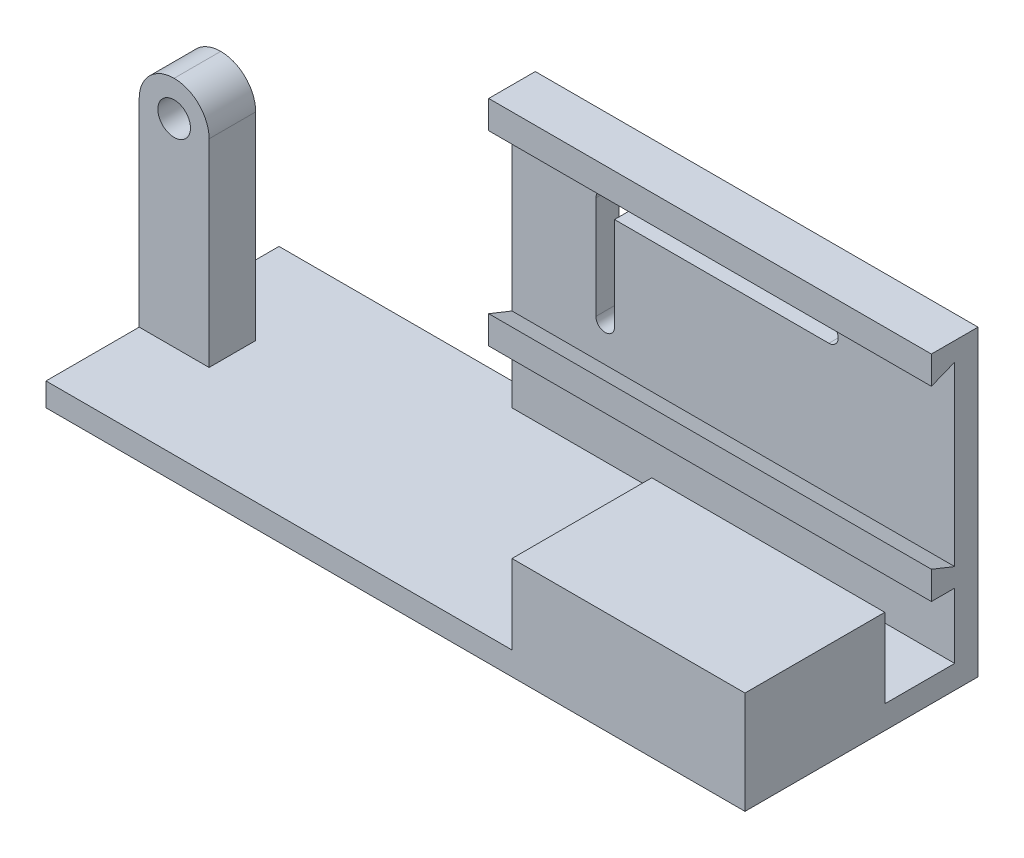
ISO-10303-21;
HEADER;
FILE_DESCRIPTION(('STEP AP214'),'2;1');
FILE_NAME('part.step','',(''),(''),'','','');
FILE_SCHEMA(('AUTOMOTIVE_DESIGN { 1 0 10303 214 1 1 1 1 }'));
ENDSEC;
DATA;
#1=APPLICATION_CONTEXT('core data for automotive mechanical design processes');
#2=APPLICATION_PROTOCOL_DEFINITION('international standard','automotive_design',2000,#1);
#3=PRODUCT_CONTEXT('',#1,'mechanical');
#4=PRODUCT('Part','Part','',(#3));
#5=PRODUCT_RELATED_PRODUCT_CATEGORY('part','',(#4));
#6=PRODUCT_DEFINITION_FORMATION('','',#4);
#7=PRODUCT_DEFINITION_CONTEXT('part definition',#1,'design');
#8=PRODUCT_DEFINITION('design','',#6,#7);
#9=PRODUCT_DEFINITION_SHAPE('','',#8);
#10=(LENGTH_UNIT() NAMED_UNIT(*) SI_UNIT(.MILLI.,.METRE.));
#11=(NAMED_UNIT(*) PLANE_ANGLE_UNIT() SI_UNIT($,.RADIAN.));
#12=(NAMED_UNIT(*) SI_UNIT($,.STERADIAN.) SOLID_ANGLE_UNIT());
#13=UNCERTAINTY_MEASURE_WITH_UNIT(LENGTH_MEASURE(1.E-05),#10,'distance_accuracy_value','');
#14=(GEOMETRIC_REPRESENTATION_CONTEXT(3) GLOBAL_UNCERTAINTY_ASSIGNED_CONTEXT((#13)) GLOBAL_UNIT_ASSIGNED_CONTEXT((#10,
#11,#12)) REPRESENTATION_CONTEXT('',''));
#15=CARTESIAN_POINT('',(0.,0.,0.));
#16=DIRECTION('',(0.,0.,1.));
#17=DIRECTION('',(1.,0.,0.));
#18=AXIS2_PLACEMENT_3D('',#15,#16,#17);
#19=CARTESIAN_POINT('',(55.,65.,-45.));
#20=DIRECTION('',(0.,0.,-1.));
#21=DIRECTION('',(-1.,0.,0.));
#22=AXIS2_PLACEMENT_3D('',#19,#20,#21);
#23=PLANE('',#22);
#24=DIRECTION('',(0.,-1.,0.));
#25=VECTOR('',#24,1.);
#26=CARTESIAN_POINT('',(150.,65.,-45.));
#27=LINE('',#26,#25);
#28=CARTESIAN_POINT('',(150.,19.,-45.));
#29=VERTEX_POINT('',#28);
#30=CARTESIAN_POINT('',(150.,4.99999999999999,-45.));
#31=VERTEX_POINT('',#30);
#32=EDGE_CURVE('E413',#29,#31,#27,.T.);
#33=ORIENTED_EDGE('',*,*,#32,.F.);
#34=DIRECTION('',(1.,0.,0.));
#35=VECTOR('',#34,1.);
#36=CARTESIAN_POINT('',(47.1897503240933,19.,-45.));
#37=LINE('',#36,#35);
#38=CARTESIAN_POINT('',(55.,19.,-45.));
#39=VERTEX_POINT('',#38);
#40=EDGE_CURVE('E304',#39,#29,#37,.T.);
#41=ORIENTED_EDGE('',*,*,#40,.F.);
#42=DIRECTION('',(0.,-1.,0.));
#43=VECTOR('',#42,1.);
#44=CARTESIAN_POINT('',(55.,65.,-45.));
#45=LINE('',#44,#43);
#46=CARTESIAN_POINT('',(55.,4.99999999999999,-45.));
#47=VERTEX_POINT('',#46);
#48=EDGE_CURVE('E418',#39,#47,#45,.T.);
#49=ORIENTED_EDGE('',*,*,#48,.T.);
#50=DIRECTION('',(1.,0.,0.));
#51=VECTOR('',#50,1.);
#52=CARTESIAN_POINT('',(55.,4.99999999999999,-45.));
#53=LINE('',#52,#51);
#54=EDGE_CURVE('E396',#47,#31,#53,.T.);
#55=ORIENTED_EDGE('',*,*,#54,.T.);
#56=EDGE_LOOP('',(#33,#41,#49,#55));
#57=FACE_BOUND('',#56,.T.);
#58=ADVANCED_FACE('F40',(#57),#23,.F.);
#59=CARTESIAN_POINT('',(0.,4.99999999999999,-50.));
#60=DIRECTION('',(0.,1.,0.));
#61=DIRECTION('',(0.,0.,1.));
#62=AXIS2_PLACEMENT_3D('',#59,#60,#61);
#63=PLANE('',#62);
#64=DIRECTION('',(-1.,0.,0.));
#65=VECTOR('',#64,1.);
#66=CARTESIAN_POINT('',(0.,4.99999999999999,0.));
#67=LINE('',#66,#65);
#68=CARTESIAN_POINT('',(100.,4.99999999999999,0.));
#69=VERTEX_POINT('',#68);
#70=CARTESIAN_POINT('',(0.,4.99999999999999,0.));
#71=VERTEX_POINT('',#70);
#72=EDGE_CURVE('E452',#69,#71,#67,.T.);
#73=ORIENTED_EDGE('',*,*,#72,.F.);
#74=DIRECTION('',(0.,0.,1.));
#75=VECTOR('',#74,1.);
#76=CARTESIAN_POINT('',(100.,4.99999999999999,-30.));
#77=LINE('',#76,#75);
#78=CARTESIAN_POINT('',(100.,4.99999999999999,-30.));
#79=VERTEX_POINT('',#78);
#80=EDGE_CURVE('E344',#79,#69,#77,.T.);
#81=ORIENTED_EDGE('',*,*,#80,.F.);
#82=DIRECTION('',(-1.,0.,0.));
#83=VECTOR('',#82,1.);
#84=CARTESIAN_POINT('',(100.,4.99999999999999,-30.));
#85=LINE('',#84,#83);
#86=CARTESIAN_POINT('',(150.,4.99999999999999,-30.));
#87=VERTEX_POINT('',#86);
#88=EDGE_CURVE('E366',#87,#79,#85,.T.);
#89=ORIENTED_EDGE('',*,*,#88,.F.);
#90=DIRECTION('',(0.,0.,1.));
#91=VECTOR('',#90,1.);
#92=CARTESIAN_POINT('',(150.,4.99999999999999,-50.));
#93=LINE('',#92,#91);
#94=EDGE_CURVE('E481',#31,#87,#93,.T.);
#95=ORIENTED_EDGE('',*,*,#94,.F.);
#96=ORIENTED_EDGE('',*,*,#54,.F.);
#97=DIRECTION('',(0.,0.,1.));
#98=VECTOR('',#97,1.);
#99=CARTESIAN_POINT('',(55.,4.99999999999999,-50.));
#100=LINE('',#99,#98);
#101=CARTESIAN_POINT('',(55.,4.99999999999999,-50.));
#102=VERTEX_POINT('',#101);
#103=EDGE_CURVE('E391',#102,#47,#100,.T.);
#104=ORIENTED_EDGE('',*,*,#103,.F.);
#105=DIRECTION('',(-1.,0.,0.));
#106=VECTOR('',#105,1.);
#107=CARTESIAN_POINT('',(0.,4.99999999999999,-50.));
#108=LINE('',#107,#106);
#109=CARTESIAN_POINT('',(0.,4.99999999999999,-50.));
#110=VERTEX_POINT('',#109);
#111=EDGE_CURVE('E459',#102,#110,#108,.T.);
#112=ORIENTED_EDGE('',*,*,#111,.T.);
#113=DIRECTION('',(0.,0.,1.));
#114=VECTOR('',#113,1.);
#115=CARTESIAN_POINT('',(0.,4.99999999999999,-50.));
#116=LINE('',#115,#114);
#117=CARTESIAN_POINT('',(0.,4.99999999999999,-30.));
#118=VERTEX_POINT('',#117);
#119=EDGE_CURVE('E475',#110,#118,#116,.T.);
#120=ORIENTED_EDGE('',*,*,#119,.T.);
#121=DIRECTION('',(1.,0.,0.));
#122=VECTOR('',#121,1.);
#123=CARTESIAN_POINT('',(0.,4.99999999999999,-30.));
#124=LINE('',#123,#122);
#125=CARTESIAN_POINT('',(15.,4.99999999999999,-30.));
#126=VERTEX_POINT('',#125);
#127=EDGE_CURVE('E426',#118,#126,#124,.T.);
#128=ORIENTED_EDGE('',*,*,#127,.T.);
#129=DIRECTION('',(0.,0.,1.));
#130=VECTOR('',#129,1.);
#131=CARTESIAN_POINT('',(15.,4.99999999999999,0.));
#132=LINE('',#131,#130);
#133=CARTESIAN_POINT('',(15.,4.99999999999999,-20.));
#134=VERTEX_POINT('',#133);
#135=EDGE_CURVE('E422',#126,#134,#132,.T.);
#136=ORIENTED_EDGE('',*,*,#135,.T.);
#137=DIRECTION('',(1.,0.,0.));
#138=VECTOR('',#137,1.);
#139=CARTESIAN_POINT('',(0.,4.99999999999999,-20.));
#140=LINE('',#139,#138);
#141=CARTESIAN_POINT('',(0.,4.99999999999999,-20.));
#142=VERTEX_POINT('',#141);
#143=EDGE_CURVE('E430',#142,#134,#140,.T.);
#144=ORIENTED_EDGE('',*,*,#143,.F.);
#145=EDGE_CURVE('E480',#142,#71,#116,.T.);
#146=ORIENTED_EDGE('',*,*,#145,.T.);
#147=EDGE_LOOP('',(#73,#81,#89,#95,#96,#104,#112,#120,#128,#136,#144,#146));
#148=FACE_BOUND('',#147,.T.);
#149=ADVANCED_FACE('F543',(#148),#63,.T.);
#150=CARTESIAN_POINT('',(0.,0.,-50.));
#151=DIRECTION('',(-1.,0.,0.));
#152=DIRECTION('',(0.,0.,1.));
#153=AXIS2_PLACEMENT_3D('',#150,#151,#152);
#154=PLANE('',#153);
#155=DIRECTION('',(0.,-1.,0.));
#156=VECTOR('',#155,1.);
#157=CARTESIAN_POINT('',(0.,55.,-20.));
#158=LINE('',#157,#156);
#159=CARTESIAN_POINT('',(0.,47.5,-20.));
#160=VERTEX_POINT('',#159);
#161=EDGE_CURVE('E437',#160,#142,#158,.T.);
#162=ORIENTED_EDGE('',*,*,#161,.F.);
#163=DIRECTION('',(0.,0.,1.));
#164=VECTOR('',#163,1.);
#165=CARTESIAN_POINT('',(0.,47.5,-50.));
#166=LINE('',#165,#164);
#167=CARTESIAN_POINT('',(0.,47.5,-30.));
#168=VERTEX_POINT('',#167);
#169=EDGE_CURVE('E49',#160,#168,#166,.F.);
#170=ORIENTED_EDGE('',*,*,#169,.T.);
#171=DIRECTION('',(0.,-1.,0.));
#172=VECTOR('',#171,1.);
#173=CARTESIAN_POINT('',(0.,55.,-30.));
#174=LINE('',#173,#172);
#175=EDGE_CURVE('E440',#168,#118,#174,.T.);
#176=ORIENTED_EDGE('',*,*,#175,.T.);
#177=ORIENTED_EDGE('',*,*,#119,.F.);
#178=DIRECTION('',(0.,-1.,0.));
#179=VECTOR('',#178,1.);
#180=CARTESIAN_POINT('',(0.,0.,-50.));
#181=LINE('',#180,#179);
#182=CARTESIAN_POINT('',(0.,0.,-50.));
#183=VERTEX_POINT('',#182);
#184=EDGE_CURVE('E447',#110,#183,#181,.T.);
#185=ORIENTED_EDGE('',*,*,#184,.T.);
#186=DIRECTION('',(0.,0.,1.));
#187=VECTOR('',#186,1.);
#188=CARTESIAN_POINT('',(0.,0.,-50.));
#189=LINE('',#188,#187);
#190=CARTESIAN_POINT('',(0.,0.,0.));
#191=VERTEX_POINT('',#190);
#192=EDGE_CURVE('E462',#183,#191,#189,.T.);
#193=ORIENTED_EDGE('',*,*,#192,.T.);
#194=DIRECTION('',(0.,-1.,0.));
#195=VECTOR('',#194,1.);
#196=CARTESIAN_POINT('',(0.,0.,0.));
#197=LINE('',#196,#195);
#198=EDGE_CURVE('E446',#71,#191,#197,.T.);
#199=ORIENTED_EDGE('',*,*,#198,.F.);
#200=ORIENTED_EDGE('',*,*,#145,.F.);
#201=EDGE_LOOP('',(#162,#170,#176,#177,#185,#193,#199,#200));
#202=FACE_BOUND('',#201,.T.);
#203=ADVANCED_FACE('F524',(#202),#154,.T.);
#204=CARTESIAN_POINT('',(150.,0.,-50.));
#205=DIRECTION('',(1.,0.,0.));
#206=DIRECTION('',(0.,0.,-1.));
#207=AXIS2_PLACEMENT_3D('',#204,#205,#206);
#208=PLANE('',#207);
#209=DIRECTION('',(0.,1.,0.));
#210=VECTOR('',#209,1.);
#211=CARTESIAN_POINT('',(150.,0.,0.));
#212=LINE('',#211,#210);
#213=CARTESIAN_POINT('',(150.,0.,0.));
#214=VERTEX_POINT('',#213);
#215=CARTESIAN_POINT('',(150.,22.,0.));
#216=VERTEX_POINT('',#215);
#217=EDGE_CURVE('E470',#214,#216,#212,.T.);
#218=ORIENTED_EDGE('',*,*,#217,.F.);
#219=DIRECTION('',(0.,0.,1.));
#220=VECTOR('',#219,1.);
#221=CARTESIAN_POINT('',(150.,0.,-50.));
#222=LINE('',#221,#220);
#223=CARTESIAN_POINT('',(150.,0.,-50.));
#224=VERTEX_POINT('',#223);
#225=EDGE_CURVE('E485',#224,#214,#222,.T.);
#226=ORIENTED_EDGE('',*,*,#225,.F.);
#227=DIRECTION('',(0.,1.,0.));
#228=VECTOR('',#227,1.);
#229=CARTESIAN_POINT('',(150.,0.,-50.));
#230=LINE('',#229,#228);
#231=CARTESIAN_POINT('',(150.,65.,-50.));
#232=VERTEX_POINT('',#231);
#233=EDGE_CURVE('E456',#224,#232,#230,.T.);
#234=ORIENTED_EDGE('',*,*,#233,.T.);
#235=DIRECTION('',(0.,0.,-1.));
#236=VECTOR('',#235,1.);
#237=CARTESIAN_POINT('',(150.,65.,-50.));
#238=LINE('',#237,#236);
#239=CARTESIAN_POINT('',(150.,65.,-40.));
#240=VERTEX_POINT('',#239);
#241=EDGE_CURVE('E395',#240,#232,#238,.T.);
#242=ORIENTED_EDGE('',*,*,#241,.F.);
#243=DIRECTION('',(0.,-1.,0.));
#244=VECTOR('',#243,1.);
#245=CARTESIAN_POINT('',(150.,65.,-40.));
#246=LINE('',#245,#244);
#247=CARTESIAN_POINT('',(150.,59.,-40.));
#248=VERTEX_POINT('',#247);
#249=EDGE_CURVE('E335',#240,#248,#246,.T.);
#250=ORIENTED_EDGE('',*,*,#249,.T.);
#251=DIRECTION('',(0.,0.371390676354102,-0.92847669088526));
#252=VECTOR('',#251,1.);
#253=CARTESIAN_POINT('',(150.,59.,-40.));
#254=LINE('',#253,#252);
#255=CARTESIAN_POINT('',(150.,61.,-45.));
#256=VERTEX_POINT('',#255);
#257=EDGE_CURVE('E348',#248,#256,#254,.T.);
#258=ORIENTED_EDGE('',*,*,#257,.T.);
#259=CARTESIAN_POINT('',(150.,23.,-45.));
#260=VERTEX_POINT('',#259);
#261=EDGE_CURVE('E414',#256,#260,#27,.T.);
#262=ORIENTED_EDGE('',*,*,#261,.T.);
#263=DIRECTION('',(0.,0.371390676354103,0.92847669088526));
#264=VECTOR('',#263,1.);
#265=CARTESIAN_POINT('',(150.,25.,-40.));
#266=LINE('',#265,#264);
#267=CARTESIAN_POINT('',(150.,25.,-40.));
#268=VERTEX_POINT('',#267);
#269=EDGE_CURVE('E308',#260,#268,#266,.T.);
#270=ORIENTED_EDGE('',*,*,#269,.T.);
#271=DIRECTION('',(0.,-1.,0.));
#272=VECTOR('',#271,1.);
#273=CARTESIAN_POINT('',(150.,19.,-40.));
#274=LINE('',#273,#272);
#275=CARTESIAN_POINT('',(150.,19.,-40.));
#276=VERTEX_POINT('',#275);
#277=EDGE_CURVE('E312',#268,#276,#274,.T.);
#278=ORIENTED_EDGE('',*,*,#277,.T.);
#279=DIRECTION('',(0.,0.,-1.));
#280=VECTOR('',#279,1.);
#281=CARTESIAN_POINT('',(150.,19.,-45.));
#282=LINE('',#281,#280);
#283=EDGE_CURVE('E316',#276,#29,#282,.T.);
#284=ORIENTED_EDGE('',*,*,#283,.T.);
#285=ORIENTED_EDGE('',*,*,#32,.T.);
#286=ORIENTED_EDGE('',*,*,#94,.T.);
#287=DIRECTION('',(0.,-1.,0.));
#288=VECTOR('',#287,1.);
#289=CARTESIAN_POINT('',(150.,22.,-30.));
#290=LINE('',#289,#288);
#291=CARTESIAN_POINT('',(150.,22.,-30.));
#292=VERTEX_POINT('',#291);
#293=EDGE_CURVE('E384',#292,#87,#290,.T.);
#294=ORIENTED_EDGE('',*,*,#293,.F.);
#295=DIRECTION('',(0.,0.,-1.));
#296=VECTOR('',#295,1.);
#297=CARTESIAN_POINT('',(150.,22.,-30.));
#298=LINE('',#297,#296);
#299=EDGE_CURVE('E370',#216,#292,#298,.T.);
#300=ORIENTED_EDGE('',*,*,#299,.F.);
#301=EDGE_LOOP('',(#218,#226,#234,#242,#250,#258,#262,#270,#278,#284,#285,#286,#294,#300));
#302=FACE_BOUND('',#301,.T.);
#303=ADVANCED_FACE('F536',(#302),#208,.T.);
#304=CARTESIAN_POINT('',(0.,0.,-50.));
#305=DIRECTION('',(0.,-1.,0.));
#306=DIRECTION('',(0.,0.,-1.));
#307=AXIS2_PLACEMENT_3D('',#304,#305,#306);
#308=PLANE('',#307);
#309=DIRECTION('',(1.,0.,0.));
#310=VECTOR('',#309,1.);
#311=CARTESIAN_POINT('',(0.,0.,0.));
#312=LINE('',#311,#310);
#313=EDGE_CURVE('E466',#191,#214,#312,.T.);
#314=ORIENTED_EDGE('',*,*,#313,.F.);
#315=ORIENTED_EDGE('',*,*,#192,.F.);
#316=DIRECTION('',(1.,0.,0.));
#317=VECTOR('',#316,1.);
#318=CARTESIAN_POINT('',(0.,0.,-50.));
#319=LINE('',#318,#317);
#320=EDGE_CURVE('E451',#183,#224,#319,.T.);
#321=ORIENTED_EDGE('',*,*,#320,.T.);
#322=ORIENTED_EDGE('',*,*,#225,.T.);
#323=EDGE_LOOP('',(#314,#315,#321,#322));
#324=FACE_BOUND('',#323,.T.);
#325=ADVANCED_FACE('F562',(#324),#308,.T.);
#326=CARTESIAN_POINT('',(0.,0.,-50.));
#327=DIRECTION('',(0.,0.,-1.));
#328=DIRECTION('',(-1.,0.,0.));
#329=AXIS2_PLACEMENT_3D('',#326,#327,#328);
#330=PLANE('',#329);
#331=DIRECTION('',(0.,-1.,0.));
#332=VECTOR('',#331,1.);
#333=CARTESIAN_POINT('',(77.,0.,-50.));
#334=LINE('',#333,#332);
#335=CARTESIAN_POINT('',(77.,51.,-50.));
#336=VERTEX_POINT('',#335);
#337=CARTESIAN_POINT('',(77.,31.,-50.));
#338=VERTEX_POINT('',#337);
#339=EDGE_CURVE('E696',#336,#338,#334,.T.);
#340=ORIENTED_EDGE('',*,*,#339,.F.);
#341=DIRECTION('',(-1.,0.,0.));
#342=VECTOR('',#341,1.);
#343=CARTESIAN_POINT('',(0.,51.,-50.));
#344=LINE('',#343,#342);
#345=CARTESIAN_POINT('',(123.,51.,-50.));
#346=VERTEX_POINT('',#345);
#347=EDGE_CURVE('E274',#346,#336,#344,.T.);
#348=ORIENTED_EDGE('',*,*,#347,.F.);
#349=CARTESIAN_POINT('',(123.,53.,-50.));
#350=DIRECTION('',(0.,0.,-1.));
#351=DIRECTION('',(-1.,0.,0.));
#352=AXIS2_PLACEMENT_3D('',#349,#350,#351);
#353=CIRCLE('',#352,2.);
#354=CARTESIAN_POINT('',(123.,55.,-50.));
#355=VERTEX_POINT('',#354);
#356=EDGE_CURVE('E282',#355,#346,#353,.T.);
#357=ORIENTED_EDGE('',*,*,#356,.F.);
#358=DIRECTION('',(1.,0.,0.));
#359=VECTOR('',#358,1.);
#360=CARTESIAN_POINT('',(0.,55.,-50.));
#361=LINE('',#360,#359);
#362=CARTESIAN_POINT('',(75.,55.,-50.));
#363=VERTEX_POINT('',#362);
#364=EDGE_CURVE('E285',#363,#355,#361,.T.);
#365=ORIENTED_EDGE('',*,*,#364,.F.);
#366=CARTESIAN_POINT('',(75.,53.,-50.));
#367=DIRECTION('',(0.,0.,-1.));
#368=DIRECTION('',(-1.,0.,0.));
#369=AXIS2_PLACEMENT_3D('',#366,#367,#368);
#370=CIRCLE('',#369,2.);
#371=CARTESIAN_POINT('',(73.,53.,-50.));
#372=VERTEX_POINT('',#371);
#373=EDGE_CURVE('E288',#372,#363,#370,.T.);
#374=ORIENTED_EDGE('',*,*,#373,.F.);
#375=DIRECTION('',(0.,1.,0.));
#376=VECTOR('',#375,1.);
#377=CARTESIAN_POINT('',(73.,0.,-50.));
#378=LINE('',#377,#376);
#379=CARTESIAN_POINT('',(73.,31.,-50.));
#380=VERTEX_POINT('',#379);
#381=EDGE_CURVE('E233',#380,#372,#378,.T.);
#382=ORIENTED_EDGE('',*,*,#381,.F.);
#383=CARTESIAN_POINT('',(75.,31.,-50.));
#384=DIRECTION('',(0.,0.,-1.));
#385=DIRECTION('',(-1.,0.,0.));
#386=AXIS2_PLACEMENT_3D('',#383,#384,#385);
#387=CIRCLE('',#386,2.);
#388=EDGE_CURVE('E257',#338,#380,#387,.T.);
#389=ORIENTED_EDGE('',*,*,#388,.F.);
#390=EDGE_LOOP('',(#340,#348,#357,#365,#374,#382,#389));
#391=FACE_BOUND('',#390,.T.);
#392=ORIENTED_EDGE('',*,*,#184,.F.);
#393=ORIENTED_EDGE('',*,*,#111,.F.);
#394=DIRECTION('',(0.,-1.,0.));
#395=VECTOR('',#394,1.);
#396=CARTESIAN_POINT('',(55.,65.,-50.));
#397=LINE('',#396,#395);
#398=CARTESIAN_POINT('',(55.,65.,-50.));
#399=VERTEX_POINT('',#398);
#400=EDGE_CURVE('E403',#399,#102,#397,.T.);
#401=ORIENTED_EDGE('',*,*,#400,.F.);
#402=DIRECTION('',(-1.,0.,0.));
#403=VECTOR('',#402,1.);
#404=CARTESIAN_POINT('',(55.,65.,-50.));
#405=LINE('',#404,#403);
#406=EDGE_CURVE('E400',#232,#399,#405,.T.);
#407=ORIENTED_EDGE('',*,*,#406,.F.);
#408=ORIENTED_EDGE('',*,*,#233,.F.);
#409=ORIENTED_EDGE('',*,*,#320,.F.);
#410=EDGE_LOOP('',(#392,#393,#401,#407,#408,#409));
#411=FACE_BOUND('',#410,.T.);
#412=ADVANCED_FACE('F557',(#391,#411),#330,.T.);
#413=CARTESIAN_POINT('',(0.,0.,0.));
#414=DIRECTION('',(0.,0.,-1.));
#415=DIRECTION('',(-1.,0.,0.));
#416=AXIS2_PLACEMENT_3D('',#413,#414,#415);
#417=PLANE('',#416);
#418=ORIENTED_EDGE('',*,*,#198,.T.);
#419=ORIENTED_EDGE('',*,*,#313,.T.);
#420=ORIENTED_EDGE('',*,*,#217,.T.);
#421=DIRECTION('',(1.,0.,0.));
#422=VECTOR('',#421,1.);
#423=CARTESIAN_POINT('',(100.,22.,0.));
#424=LINE('',#423,#422);
#425=CARTESIAN_POINT('',(100.,22.,0.));
#426=VERTEX_POINT('',#425);
#427=EDGE_CURVE('E365',#426,#216,#424,.T.);
#428=ORIENTED_EDGE('',*,*,#427,.F.);
#429=DIRECTION('',(0.,-1.,0.));
#430=VECTOR('',#429,1.);
#431=CARTESIAN_POINT('',(100.,22.,0.));
#432=LINE('',#431,#430);
#433=EDGE_CURVE('E387',#426,#69,#432,.T.);
#434=ORIENTED_EDGE('',*,*,#433,.T.);
#435=ORIENTED_EDGE('',*,*,#72,.T.);
#436=EDGE_LOOP('',(#418,#419,#420,#428,#434,#435));
#437=FACE_BOUND('',#436,.T.);
#438=ADVANCED_FACE('F564',(#437),#417,.F.);
#439=CARTESIAN_POINT('',(15.,55.,0.));
#440=DIRECTION('',(1.,0.,0.));
#441=DIRECTION('',(0.,0.,-1.));
#442=AXIS2_PLACEMENT_3D('',#439,#440,#441);
#443=PLANE('',#442);
#444=DIRECTION('',(0.,-1.,0.));
#445=VECTOR('',#444,1.);
#446=CARTESIAN_POINT('',(15.,55.,-30.));
#447=LINE('',#446,#445);
#448=CARTESIAN_POINT('',(15.,47.5,-30.));
#449=VERTEX_POINT('',#448);
#450=EDGE_CURVE('E443',#449,#126,#447,.T.);
#451=ORIENTED_EDGE('',*,*,#450,.F.);
#452=DIRECTION('',(0.,0.,1.));
#453=VECTOR('',#452,1.);
#454=CARTESIAN_POINT('',(15.,47.5,0.));
#455=LINE('',#454,#453);
#456=CARTESIAN_POINT('',(15.,47.5,-20.));
#457=VERTEX_POINT('',#456);
#458=EDGE_CURVE('E479',#449,#457,#455,.T.);
#459=ORIENTED_EDGE('',*,*,#458,.T.);
#460=DIRECTION('',(0.,-1.,0.));
#461=VECTOR('',#460,1.);
#462=CARTESIAN_POINT('',(15.,55.,-20.));
#463=LINE('',#462,#461);
#464=EDGE_CURVE('E434',#457,#134,#463,.T.);
#465=ORIENTED_EDGE('',*,*,#464,.T.);
#466=ORIENTED_EDGE('',*,*,#135,.F.);
#467=EDGE_LOOP('',(#451,#459,#465,#466));
#468=FACE_BOUND('',#467,.T.);
#469=ADVANCED_FACE('F612',(#468),#443,.T.);
#470=CARTESIAN_POINT('',(0.,55.,-30.));
#471=DIRECTION('',(0.,0.,-1.));
#472=DIRECTION('',(-1.,0.,0.));
#473=AXIS2_PLACEMENT_3D('',#470,#471,#472);
#474=PLANE('',#473);
#475=CARTESIAN_POINT('',(7.5,47.5,-30.));
#476=DIRECTION('',(0.,0.,-1.));
#477=DIRECTION('',(-1.,0.,0.));
#478=AXIS2_PLACEMENT_3D('',#475,#476,#477);
#479=CIRCLE('',#478,3.5);
#480=CARTESIAN_POINT('',(4.,47.5,-30.));
#481=VERTEX_POINT('',#480);
#482=EDGE_CURVE('E295',#481,#481,#479,.T.);
#483=ORIENTED_EDGE('',*,*,#482,.F.);
#484=EDGE_LOOP('',(#483));
#485=FACE_BOUND('',#484,.T.);
#486=CARTESIAN_POINT('',(7.5,47.5,-30.));
#487=DIRECTION('',(0.,0.,-1.));
#488=DIRECTION('',(-1.,0.,0.));
#489=AXIS2_PLACEMENT_3D('',#486,#487,#488);
#490=CIRCLE('',#489,7.5);
#491=CARTESIAN_POINT('',(7.5,55.,-30.));
#492=VERTEX_POINT('',#491);
#493=EDGE_CURVE('E499',#168,#492,#490,.T.);
#494=ORIENTED_EDGE('',*,*,#493,.T.);
#495=CARTESIAN_POINT('',(7.5,47.5,-30.));
#496=DIRECTION('',(0.,0.,-1.));
#497=DIRECTION('',(-1.,0.,0.));
#498=AXIS2_PLACEMENT_3D('',#495,#496,#497);
#499=CIRCLE('',#498,7.5);
#500=EDGE_CURVE('E502',#492,#449,#499,.T.);
#501=ORIENTED_EDGE('',*,*,#500,.T.);
#502=ORIENTED_EDGE('',*,*,#450,.T.);
#503=ORIENTED_EDGE('',*,*,#127,.F.);
#504=ORIENTED_EDGE('',*,*,#175,.F.);
#505=EDGE_LOOP('',(#494,#501,#502,#503,#504));
#506=FACE_BOUND('',#505,.T.);
#507=ADVANCED_FACE('F606',(#485,#506),#474,.T.);
#508=CARTESIAN_POINT('',(0.,55.,-20.));
#509=DIRECTION('',(0.,0.,-1.));
#510=DIRECTION('',(-1.,0.,0.));
#511=AXIS2_PLACEMENT_3D('',#508,#509,#510);
#512=PLANE('',#511);
#513=CARTESIAN_POINT('',(7.5,47.5,-20.));
#514=DIRECTION('',(0.,0.,1.));
#515=DIRECTION('',(1.,0.,0.));
#516=AXIS2_PLACEMENT_3D('',#513,#514,#515);
#517=CIRCLE('',#516,3.5);
#518=CARTESIAN_POINT('',(11.,47.5,-20.));
#519=VERTEX_POINT('',#518);
#520=EDGE_CURVE('E291',#519,#519,#517,.T.);
#521=ORIENTED_EDGE('',*,*,#520,.F.);
#522=EDGE_LOOP('',(#521));
#523=FACE_BOUND('',#522,.T.);
#524=ORIENTED_EDGE('',*,*,#464,.F.);
#525=CARTESIAN_POINT('',(7.5,47.5,-20.));
#526=DIRECTION('',(0.,0.,-1.));
#527=DIRECTION('',(-1.,0.,0.));
#528=AXIS2_PLACEMENT_3D('',#525,#526,#527);
#529=CIRCLE('',#528,7.5);
#530=CARTESIAN_POINT('',(7.5,55.,-20.));
#531=VERTEX_POINT('',#530);
#532=EDGE_CURVE('E496',#457,#531,#529,.F.);
#533=ORIENTED_EDGE('',*,*,#532,.T.);
#534=CARTESIAN_POINT('',(7.5,47.5,-20.));
#535=DIRECTION('',(0.,0.,-1.));
#536=DIRECTION('',(-1.,0.,0.));
#537=AXIS2_PLACEMENT_3D('',#534,#535,#536);
#538=CIRCLE('',#537,7.5);
#539=EDGE_CURVE('E493',#531,#160,#538,.F.);
#540=ORIENTED_EDGE('',*,*,#539,.T.);
#541=ORIENTED_EDGE('',*,*,#161,.T.);
#542=ORIENTED_EDGE('',*,*,#143,.T.);
#543=EDGE_LOOP('',(#524,#533,#540,#541,#542));
#544=FACE_BOUND('',#543,.T.);
#545=ADVANCED_FACE('F520',(#523,#544),#512,.F.);
#546=CARTESIAN_POINT('',(55.,65.,-50.));
#547=DIRECTION('',(1.,0.,0.));
#548=DIRECTION('',(0.,0.,-1.));
#549=AXIS2_PLACEMENT_3D('',#546,#547,#548);
#550=PLANE('',#549);
#551=ORIENTED_EDGE('',*,*,#103,.T.);
#552=ORIENTED_EDGE('',*,*,#48,.F.);
#553=DIRECTION('',(0.,0.,1.));
#554=VECTOR('',#553,1.);
#555=CARTESIAN_POINT('',(55.,19.,-45.));
#556=LINE('',#555,#554);
#557=CARTESIAN_POINT('',(55.,19.,-40.));
#558=VERTEX_POINT('',#557);
#559=EDGE_CURVE('E303',#39,#558,#556,.T.);
#560=ORIENTED_EDGE('',*,*,#559,.T.);
#561=DIRECTION('',(0.,1.,0.));
#562=VECTOR('',#561,1.);
#563=CARTESIAN_POINT('',(55.,19.,-40.));
#564=LINE('',#563,#562);
#565=CARTESIAN_POINT('',(55.,25.,-40.));
#566=VERTEX_POINT('',#565);
#567=EDGE_CURVE('E300',#558,#566,#564,.T.);
#568=ORIENTED_EDGE('',*,*,#567,.T.);
#569=DIRECTION('',(0.,-0.371390676354103,-0.92847669088526));
#570=VECTOR('',#569,1.);
#571=CARTESIAN_POINT('',(55.,25.,-40.));
#572=LINE('',#571,#570);
#573=CARTESIAN_POINT('',(55.,23.,-45.));
#574=VERTEX_POINT('',#573);
#575=EDGE_CURVE('E307',#566,#574,#572,.T.);
#576=ORIENTED_EDGE('',*,*,#575,.T.);
#577=CARTESIAN_POINT('',(55.,61.,-45.));
#578=VERTEX_POINT('',#577);
#579=EDGE_CURVE('E419',#578,#574,#45,.T.);
#580=ORIENTED_EDGE('',*,*,#579,.F.);
#581=DIRECTION('',(0.,-0.371390676354102,0.92847669088526));
#582=VECTOR('',#581,1.);
#583=CARTESIAN_POINT('',(55.,59.,-40.));
#584=LINE('',#583,#582);
#585=CARTESIAN_POINT('',(55.,59.,-40.));
#586=VERTEX_POINT('',#585);
#587=EDGE_CURVE('E340',#578,#586,#584,.T.);
#588=ORIENTED_EDGE('',*,*,#587,.T.);
#589=DIRECTION('',(0.,1.,0.));
#590=VECTOR('',#589,1.);
#591=CARTESIAN_POINT('',(55.,65.,-40.));
#592=LINE('',#591,#590);
#593=CARTESIAN_POINT('',(55.,65.,-40.));
#594=VERTEX_POINT('',#593);
#595=EDGE_CURVE('E336',#586,#594,#592,.T.);
#596=ORIENTED_EDGE('',*,*,#595,.T.);
#597=DIRECTION('',(0.,0.,1.));
#598=VECTOR('',#597,1.);
#599=CARTESIAN_POINT('',(55.,65.,-50.));
#600=LINE('',#599,#598);
#601=EDGE_CURVE('E392',#399,#594,#600,.T.);
#602=ORIENTED_EDGE('',*,*,#601,.F.);
#603=ORIENTED_EDGE('',*,*,#400,.T.);
#604=EDGE_LOOP('',(#551,#552,#560,#568,#576,#580,#588,#596,#602,#603));
#605=FACE_BOUND('',#604,.T.);
#606=ADVANCED_FACE('F548',(#605),#550,.F.);
#607=DIRECTION('',(1.,0.,0.));
#608=VECTOR('',#607,1.);
#609=CARTESIAN_POINT('',(75.,51.,-45.));
#610=LINE('',#609,#608);
#611=CARTESIAN_POINT('',(77.,51.,-45.));
#612=VERTEX_POINT('',#611);
#613=CARTESIAN_POINT('',(123.,51.,-45.));
#614=VERTEX_POINT('',#613);
#615=EDGE_CURVE('E256',#612,#614,#610,.T.);
#616=ORIENTED_EDGE('',*,*,#615,.F.);
#617=DIRECTION('',(0.,1.,0.));
#618=VECTOR('',#617,1.);
#619=CARTESIAN_POINT('',(77.,53.,-45.));
#620=LINE('',#619,#618);
#621=CARTESIAN_POINT('',(77.,31.,-45.));
#622=VERTEX_POINT('',#621);
#623=EDGE_CURVE('E56',#622,#612,#620,.T.);
#624=ORIENTED_EDGE('',*,*,#623,.F.);
#625=CARTESIAN_POINT('',(75.,31.,-45.));
#626=DIRECTION('',(0.,0.,1.));
#627=DIRECTION('',(1.,0.,0.));
#628=AXIS2_PLACEMENT_3D('',#625,#626,#627);
#629=CIRCLE('',#628,2.);
#630=CARTESIAN_POINT('',(73.,31.,-45.));
#631=VERTEX_POINT('',#630);
#632=EDGE_CURVE('E248',#631,#622,#629,.T.);
#633=ORIENTED_EDGE('',*,*,#632,.F.);
#634=DIRECTION('',(0.,-1.,0.));
#635=VECTOR('',#634,1.);
#636=CARTESIAN_POINT('',(73.,53.,-45.));
#637=LINE('',#636,#635);
#638=CARTESIAN_POINT('',(73.,53.,-45.));
#639=VERTEX_POINT('',#638);
#640=EDGE_CURVE('E230',#639,#631,#637,.T.);
#641=ORIENTED_EDGE('',*,*,#640,.F.);
#642=CARTESIAN_POINT('',(75.,53.,-45.));
#643=DIRECTION('',(0.,0.,1.));
#644=DIRECTION('',(1.,0.,0.));
#645=AXIS2_PLACEMENT_3D('',#642,#643,#644);
#646=CIRCLE('',#645,2.);
#647=CARTESIAN_POINT('',(75.,55.,-45.));
#648=VERTEX_POINT('',#647);
#649=EDGE_CURVE('E246',#648,#639,#646,.T.);
#650=ORIENTED_EDGE('',*,*,#649,.F.);
#651=DIRECTION('',(-1.,0.,0.));
#652=VECTOR('',#651,1.);
#653=CARTESIAN_POINT('',(75.,55.,-45.));
#654=LINE('',#653,#652);
#655=CARTESIAN_POINT('',(123.,55.,-45.));
#656=VERTEX_POINT('',#655);
#657=EDGE_CURVE('E269',#656,#648,#654,.T.);
#658=ORIENTED_EDGE('',*,*,#657,.F.);
#659=CARTESIAN_POINT('',(123.,53.,-45.));
#660=DIRECTION('',(0.,0.,1.));
#661=DIRECTION('',(1.,0.,0.));
#662=AXIS2_PLACEMENT_3D('',#659,#660,#661);
#663=CIRCLE('',#662,2.);
#664=EDGE_CURVE('E261',#614,#656,#663,.T.);
#665=ORIENTED_EDGE('',*,*,#664,.F.);
#666=EDGE_LOOP('',(#616,#624,#633,#641,#650,#658,#665));
#667=FACE_BOUND('',#666,.T.);
#668=ORIENTED_EDGE('',*,*,#579,.T.);
#669=DIRECTION('',(1.,0.,0.));
#670=VECTOR('',#669,1.);
#671=CARTESIAN_POINT('',(47.1897503240933,23.,-45.));
#672=LINE('',#671,#670);
#673=EDGE_CURVE('E320',#574,#260,#672,.T.);
#674=ORIENTED_EDGE('',*,*,#673,.T.);
#675=ORIENTED_EDGE('',*,*,#261,.F.);
#676=DIRECTION('',(1.,0.,0.));
#677=VECTOR('',#676,1.);
#678=CARTESIAN_POINT('',(47.1897503240933,61.,-45.));
#679=LINE('',#678,#677);
#680=EDGE_CURVE('E341',#578,#256,#679,.T.);
#681=ORIENTED_EDGE('',*,*,#680,.F.);
#682=EDGE_LOOP('',(#668,#674,#675,#681));
#683=FACE_BOUND('',#682,.T.);
#684=ADVANCED_FACE('F243',(#667,#683),#23,.F.);
#685=CARTESIAN_POINT('',(0.,65.,0.));
#686=DIRECTION('',(0.,1.,0.));
#687=DIRECTION('',(0.,0.,1.));
#688=AXIS2_PLACEMENT_3D('',#685,#686,#687);
#689=PLANE('',#688);
#690=ORIENTED_EDGE('',*,*,#601,.T.);
#691=DIRECTION('',(1.,0.,0.));
#692=VECTOR('',#691,1.);
#693=CARTESIAN_POINT('',(47.1897503240933,65.,-40.));
#694=LINE('',#693,#692);
#695=EDGE_CURVE('E352',#594,#240,#694,.T.);
#696=ORIENTED_EDGE('',*,*,#695,.T.);
#697=ORIENTED_EDGE('',*,*,#241,.T.);
#698=ORIENTED_EDGE('',*,*,#406,.T.);
#699=EDGE_LOOP('',(#690,#696,#697,#698));
#700=FACE_BOUND('',#699,.T.);
#701=ADVANCED_FACE('F597',(#700),#689,.T.);
#702=CARTESIAN_POINT('',(100.,22.,-30.));
#703=DIRECTION('',(1.,0.,0.));
#704=DIRECTION('',(0.,0.,-1.));
#705=AXIS2_PLACEMENT_3D('',#702,#703,#704);
#706=PLANE('',#705);
#707=ORIENTED_EDGE('',*,*,#80,.T.);
#708=ORIENTED_EDGE('',*,*,#433,.F.);
#709=DIRECTION('',(0.,0.,1.));
#710=VECTOR('',#709,1.);
#711=CARTESIAN_POINT('',(100.,22.,-30.));
#712=LINE('',#711,#710);
#713=CARTESIAN_POINT('',(100.,22.,-30.));
#714=VERTEX_POINT('',#713);
#715=EDGE_CURVE('E361',#714,#426,#712,.T.);
#716=ORIENTED_EDGE('',*,*,#715,.F.);
#717=DIRECTION('',(0.,-1.,0.));
#718=VECTOR('',#717,1.);
#719=CARTESIAN_POINT('',(100.,22.,-30.));
#720=LINE('',#719,#718);
#721=EDGE_CURVE('E376',#714,#79,#720,.T.);
#722=ORIENTED_EDGE('',*,*,#721,.T.);
#723=EDGE_LOOP('',(#707,#708,#716,#722));
#724=FACE_BOUND('',#723,.T.);
#725=ADVANCED_FACE('F567',(#724),#706,.F.);
#726=CARTESIAN_POINT('',(100.,22.,-30.));
#727=DIRECTION('',(0.,0.,1.));
#728=DIRECTION('',(1.,0.,0.));
#729=AXIS2_PLACEMENT_3D('',#726,#727,#728);
#730=PLANE('',#729);
#731=ORIENTED_EDGE('',*,*,#88,.T.);
#732=ORIENTED_EDGE('',*,*,#721,.F.);
#733=DIRECTION('',(-1.,0.,0.));
#734=VECTOR('',#733,1.);
#735=CARTESIAN_POINT('',(100.,22.,-30.));
#736=LINE('',#735,#734);
#737=EDGE_CURVE('E373',#292,#714,#736,.T.);
#738=ORIENTED_EDGE('',*,*,#737,.F.);
#739=ORIENTED_EDGE('',*,*,#293,.T.);
#740=EDGE_LOOP('',(#731,#732,#738,#739));
#741=FACE_BOUND('',#740,.T.);
#742=ADVANCED_FACE('F572',(#741),#730,.F.);
#743=CARTESIAN_POINT('',(0.,22.,0.));
#744=DIRECTION('',(0.,1.,0.));
#745=DIRECTION('',(0.,0.,1.));
#746=AXIS2_PLACEMENT_3D('',#743,#744,#745);
#747=PLANE('',#746);
#748=ORIENTED_EDGE('',*,*,#715,.T.);
#749=ORIENTED_EDGE('',*,*,#427,.T.);
#750=ORIENTED_EDGE('',*,*,#299,.T.);
#751=ORIENTED_EDGE('',*,*,#737,.T.);
#752=EDGE_LOOP('',(#748,#749,#750,#751));
#753=FACE_BOUND('',#752,.T.);
#754=ADVANCED_FACE('F575',(#753),#747,.T.);
#755=CARTESIAN_POINT('',(47.1897503240933,59.,-40.));
#756=DIRECTION('',(0.,-0.92847669088526,-0.371390676354102));
#757=DIRECTION('',(0.,0.371390676354102,-0.92847669088526));
#758=AXIS2_PLACEMENT_3D('',#755,#756,#757);
#759=PLANE('',#758);
#760=ORIENTED_EDGE('',*,*,#587,.F.);
#761=ORIENTED_EDGE('',*,*,#680,.T.);
#762=ORIENTED_EDGE('',*,*,#257,.F.);
#763=DIRECTION('',(1.,0.,0.));
#764=VECTOR('',#763,1.);
#765=CARTESIAN_POINT('',(47.1897503240933,59.,-40.));
#766=LINE('',#765,#764);
#767=EDGE_CURVE('E355',#586,#248,#766,.T.);
#768=ORIENTED_EDGE('',*,*,#767,.F.);
#769=EDGE_LOOP('',(#760,#761,#762,#768));
#770=FACE_BOUND('',#769,.T.);
#771=ADVANCED_FACE('F577',(#770),#759,.T.);
#772=CARTESIAN_POINT('',(47.1897503240933,65.,-40.));
#773=DIRECTION('',(0.,0.,1.));
#774=DIRECTION('',(0.,-1.,0.));
#775=AXIS2_PLACEMENT_3D('',#772,#773,#774);
#776=PLANE('',#775);
#777=ORIENTED_EDGE('',*,*,#595,.F.);
#778=ORIENTED_EDGE('',*,*,#767,.T.);
#779=ORIENTED_EDGE('',*,*,#249,.F.);
#780=ORIENTED_EDGE('',*,*,#695,.F.);
#781=EDGE_LOOP('',(#777,#778,#779,#780));
#782=FACE_BOUND('',#781,.T.);
#783=ADVANCED_FACE('F583',(#782),#776,.T.);
#784=CARTESIAN_POINT('',(47.1897503240933,19.,-45.));
#785=DIRECTION('',(0.,-1.,0.));
#786=DIRECTION('',(0.,0.,-1.));
#787=AXIS2_PLACEMENT_3D('',#784,#785,#786);
#788=PLANE('',#787);
#789=ORIENTED_EDGE('',*,*,#559,.F.);
#790=ORIENTED_EDGE('',*,*,#40,.T.);
#791=ORIENTED_EDGE('',*,*,#283,.F.);
#792=DIRECTION('',(1.,0.,0.));
#793=VECTOR('',#792,1.);
#794=CARTESIAN_POINT('',(47.1897503240933,19.,-40.));
#795=LINE('',#794,#793);
#796=EDGE_CURVE('E324',#558,#276,#795,.T.);
#797=ORIENTED_EDGE('',*,*,#796,.F.);
#798=EDGE_LOOP('',(#789,#790,#791,#797));
#799=FACE_BOUND('',#798,.T.);
#800=ADVANCED_FACE('F645',(#799),#788,.T.);
#801=CARTESIAN_POINT('',(47.1897503240933,19.,-40.));
#802=DIRECTION('',(0.,0.,1.));
#803=DIRECTION('',(1.,0.,0.));
#804=AXIS2_PLACEMENT_3D('',#801,#802,#803);
#805=PLANE('',#804);
#806=ORIENTED_EDGE('',*,*,#567,.F.);
#807=ORIENTED_EDGE('',*,*,#796,.T.);
#808=ORIENTED_EDGE('',*,*,#277,.F.);
#809=DIRECTION('',(1.,0.,0.));
#810=VECTOR('',#809,1.);
#811=CARTESIAN_POINT('',(47.1897503240933,25.,-40.));
#812=LINE('',#811,#810);
#813=EDGE_CURVE('E327',#566,#268,#812,.T.);
#814=ORIENTED_EDGE('',*,*,#813,.F.);
#815=EDGE_LOOP('',(#806,#807,#808,#814));
#816=FACE_BOUND('',#815,.T.);
#817=ADVANCED_FACE('F639',(#816),#805,.T.);
#818=CARTESIAN_POINT('',(47.1897503240933,25.,-40.));
#819=DIRECTION('',(0.,0.92847669088526,-0.371390676354103));
#820=DIRECTION('',(0.,0.371390676354103,0.92847669088526));
#821=AXIS2_PLACEMENT_3D('',#818,#819,#820);
#822=PLANE('',#821);
#823=ORIENTED_EDGE('',*,*,#575,.F.);
#824=ORIENTED_EDGE('',*,*,#813,.T.);
#825=ORIENTED_EDGE('',*,*,#269,.F.);
#826=ORIENTED_EDGE('',*,*,#673,.F.);
#827=EDGE_LOOP('',(#823,#824,#825,#826));
#828=FACE_BOUND('',#827,.T.);
#829=ADVANCED_FACE('F635',(#828),#822,.T.);
#830=CARTESIAN_POINT('',(7.5,47.5,0.));
#831=DIRECTION('',(0.,0.,1.));
#832=DIRECTION('',(1.,0.,0.));
#833=AXIS2_PLACEMENT_3D('',#830,#831,#832);
#834=CYLINDRICAL_SURFACE('',#833,7.5);
#835=DIRECTION('',(0.,0.,1.));
#836=VECTOR('',#835,1.);
#837=CARTESIAN_POINT('',(7.5,55.,0.));
#838=LINE('',#837,#836);
#839=EDGE_CURVE('E299',#492,#531,#838,.T.);
#840=ORIENTED_EDGE('',*,*,#839,.F.);
#841=ORIENTED_EDGE('',*,*,#493,.F.);
#842=ORIENTED_EDGE('',*,*,#169,.F.);
#843=ORIENTED_EDGE('',*,*,#539,.F.);
#844=EDGE_LOOP('',(#840,#841,#842,#843));
#845=FACE_BOUND('',#844,.T.);
#846=ADVANCED_FACE('F42',(#845),#834,.T.);
#847=CARTESIAN_POINT('',(7.50000000000001,47.5,0.));
#848=DIRECTION('',(0.,0.,1.));
#849=DIRECTION('',(1.,0.,0.));
#850=AXIS2_PLACEMENT_3D('',#847,#848,#849);
#851=CYLINDRICAL_SURFACE('',#850,7.5);
#852=ORIENTED_EDGE('',*,*,#500,.F.);
#853=ORIENTED_EDGE('',*,*,#839,.T.);
#854=ORIENTED_EDGE('',*,*,#532,.F.);
#855=ORIENTED_EDGE('',*,*,#458,.F.);
#856=EDGE_LOOP('',(#852,#853,#854,#855));
#857=FACE_BOUND('',#856,.T.);
#858=ADVANCED_FACE('F511',(#857),#851,.T.);
#859=CARTESIAN_POINT('',(7.5,47.5,-50.));
#860=DIRECTION('',(0.,0.,1.));
#861=DIRECTION('',(1.,0.,0.));
#862=AXIS2_PLACEMENT_3D('',#859,#860,#861);
#863=CYLINDRICAL_SURFACE('',#862,3.5);
#864=ORIENTED_EDGE('',*,*,#482,.T.);
#865=EDGE_LOOP('',(#864));
#866=FACE_BOUND('',#865,.T.);
#867=ORIENTED_EDGE('',*,*,#520,.T.);
#868=EDGE_LOOP('',(#867));
#869=FACE_BOUND('',#868,.T.);
#870=ADVANCED_FACE('F628',(#866,#869),#863,.F.);
#871=CARTESIAN_POINT('',(75.,53.,-55.));
#872=DIRECTION('',(0.,0.,1.));
#873=DIRECTION('',(1.,0.,0.));
#874=AXIS2_PLACEMENT_3D('',#871,#872,#873);
#875=CYLINDRICAL_SURFACE('',#874,2.);
#876=ORIENTED_EDGE('',*,*,#649,.T.);
#877=DIRECTION('',(0.,0.,1.));
#878=VECTOR('',#877,1.);
#879=CARTESIAN_POINT('',(73.,53.,-55.));
#880=LINE('',#879,#878);
#881=EDGE_CURVE('E226',#372,#639,#880,.T.);
#882=ORIENTED_EDGE('',*,*,#881,.F.);
#883=ORIENTED_EDGE('',*,*,#373,.T.);
#884=DIRECTION('',(0.,0.,1.));
#885=VECTOR('',#884,1.);
#886=CARTESIAN_POINT('',(75.,55.,-55.));
#887=LINE('',#886,#885);
#888=EDGE_CURVE('E253',#363,#648,#887,.T.);
#889=ORIENTED_EDGE('',*,*,#888,.T.);
#890=EDGE_LOOP('',(#876,#882,#883,#889));
#891=FACE_BOUND('',#890,.T.);
#892=ADVANCED_FACE('F251',(#891),#875,.F.);
#893=CARTESIAN_POINT('',(75.,55.,-55.));
#894=DIRECTION('',(0.,1.,0.));
#895=DIRECTION('',(0.,0.,1.));
#896=AXIS2_PLACEMENT_3D('',#893,#894,#895);
#897=PLANE('',#896);
#898=ORIENTED_EDGE('',*,*,#364,.T.);
#899=DIRECTION('',(0.,0.,1.));
#900=VECTOR('',#899,1.);
#901=CARTESIAN_POINT('',(123.,55.,-55.));
#902=LINE('',#901,#900);
#903=EDGE_CURVE('E275',#355,#656,#902,.T.);
#904=ORIENTED_EDGE('',*,*,#903,.T.);
#905=ORIENTED_EDGE('',*,*,#657,.T.);
#906=ORIENTED_EDGE('',*,*,#888,.F.);
#907=EDGE_LOOP('',(#898,#904,#905,#906));
#908=FACE_BOUND('',#907,.T.);
#909=ADVANCED_FACE('F674',(#908),#897,.F.);
#910=CARTESIAN_POINT('',(123.,53.,-55.));
#911=DIRECTION('',(0.,0.,1.));
#912=DIRECTION('',(1.,0.,0.));
#913=AXIS2_PLACEMENT_3D('',#910,#911,#912);
#914=CYLINDRICAL_SURFACE('',#913,2.);
#915=ORIENTED_EDGE('',*,*,#356,.T.);
#916=DIRECTION('',(0.,0.,1.));
#917=VECTOR('',#916,1.);
#918=CARTESIAN_POINT('',(123.,51.,-55.));
#919=LINE('',#918,#917);
#920=EDGE_CURVE('E63',#346,#614,#919,.T.);
#921=ORIENTED_EDGE('',*,*,#920,.T.);
#922=ORIENTED_EDGE('',*,*,#664,.T.);
#923=ORIENTED_EDGE('',*,*,#903,.F.);
#924=EDGE_LOOP('',(#915,#921,#922,#923));
#925=FACE_BOUND('',#924,.T.);
#926=ADVANCED_FACE('F679',(#925),#914,.F.);
#927=CARTESIAN_POINT('',(75.,51.,-55.));
#928=DIRECTION('',(0.,-1.,0.));
#929=DIRECTION('',(0.,0.,-1.));
#930=AXIS2_PLACEMENT_3D('',#927,#928,#929);
#931=PLANE('',#930);
#932=ORIENTED_EDGE('',*,*,#347,.T.);
#933=DIRECTION('',(0.,0.,1.));
#934=VECTOR('',#933,1.);
#935=CARTESIAN_POINT('',(77.,51.,-55.));
#936=LINE('',#935,#934);
#937=EDGE_CURVE('E11',#336,#612,#936,.T.);
#938=ORIENTED_EDGE('',*,*,#937,.T.);
#939=ORIENTED_EDGE('',*,*,#615,.T.);
#940=ORIENTED_EDGE('',*,*,#920,.F.);
#941=EDGE_LOOP('',(#932,#938,#939,#940));
#942=FACE_BOUND('',#941,.T.);
#943=ADVANCED_FACE('F675',(#942),#931,.F.);
#944=CARTESIAN_POINT('',(77.,53.,-55.));
#945=DIRECTION('',(1.,0.,0.));
#946=DIRECTION('',(0.,0.,-1.));
#947=AXIS2_PLACEMENT_3D('',#944,#945,#946);
#948=PLANE('',#947);
#949=ORIENTED_EDGE('',*,*,#339,.T.);
#950=DIRECTION('',(0.,0.,1.));
#951=VECTOR('',#950,1.);
#952=CARTESIAN_POINT('',(77.,31.,-55.));
#953=LINE('',#952,#951);
#954=EDGE_CURVE('E698',#338,#622,#953,.T.);
#955=ORIENTED_EDGE('',*,*,#954,.T.);
#956=ORIENTED_EDGE('',*,*,#623,.T.);
#957=ORIENTED_EDGE('',*,*,#937,.F.);
#958=EDGE_LOOP('',(#949,#955,#956,#957));
#959=FACE_BOUND('',#958,.T.);
#960=ADVANCED_FACE('F678',(#959),#948,.F.);
#961=CARTESIAN_POINT('',(75.,31.,-55.));
#962=DIRECTION('',(0.,0.,1.));
#963=DIRECTION('',(1.,0.,0.));
#964=AXIS2_PLACEMENT_3D('',#961,#962,#963);
#965=CYLINDRICAL_SURFACE('',#964,2.);
#966=ORIENTED_EDGE('',*,*,#388,.T.);
#967=DIRECTION('',(0.,0.,1.));
#968=VECTOR('',#967,1.);
#969=CARTESIAN_POINT('',(73.,31.,-55.));
#970=LINE('',#969,#968);
#971=EDGE_CURVE('E238',#380,#631,#970,.T.);
#972=ORIENTED_EDGE('',*,*,#971,.T.);
#973=ORIENTED_EDGE('',*,*,#632,.T.);
#974=ORIENTED_EDGE('',*,*,#954,.F.);
#975=EDGE_LOOP('',(#966,#972,#973,#974));
#976=FACE_BOUND('',#975,.T.);
#977=ADVANCED_FACE('F688',(#976),#965,.F.);
#978=CARTESIAN_POINT('',(73.,53.,-55.));
#979=DIRECTION('',(-1.,0.,0.));
#980=DIRECTION('',(0.,0.,1.));
#981=AXIS2_PLACEMENT_3D('',#978,#979,#980);
#982=PLANE('',#981);
#983=ORIENTED_EDGE('',*,*,#381,.T.);
#984=ORIENTED_EDGE('',*,*,#881,.T.);
#985=ORIENTED_EDGE('',*,*,#640,.T.);
#986=ORIENTED_EDGE('',*,*,#971,.F.);
#987=EDGE_LOOP('',(#983,#984,#985,#986));
#988=FACE_BOUND('',#987,.T.);
#989=ADVANCED_FACE('F228',(#988),#982,.F.);
#990=CLOSED_SHELL('',(#58,#149,#203,#303,#325,#412,#438,#469,#507,#545,#606,#684,#701,#725,#742,
#754,#771,#783,#800,#817,#829,#846,#858,#870,#892,#909,#926,#943,#960,#977,#989));
#991=MANIFOLD_SOLID_BREP('B2',#990);
#992=ADVANCED_BREP_SHAPE_REPRESENTATION('',(#18,#991),#14);
#993=SHAPE_DEFINITION_REPRESENTATION(#9,#992);
ENDSEC;
END-ISO-10303-21;
